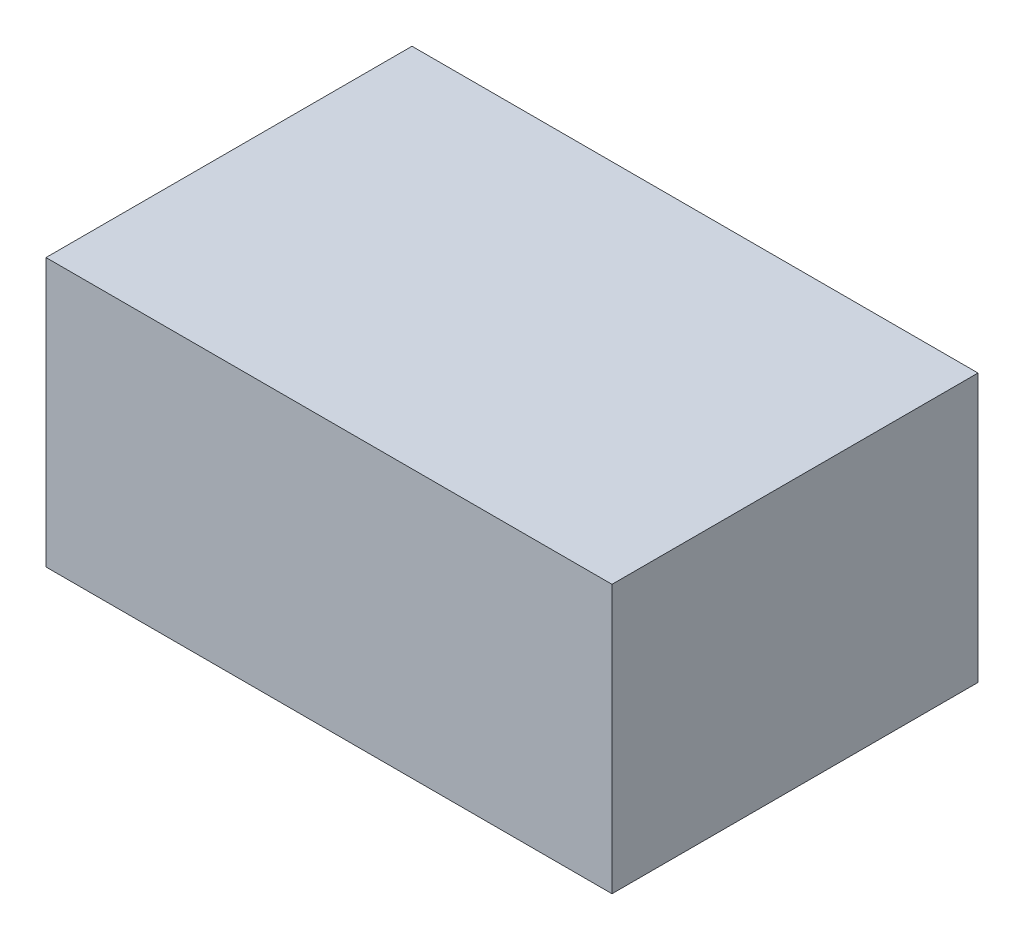
ISO-10303-21;
HEADER;
FILE_DESCRIPTION(('STEP AP214'),'2;1');
FILE_NAME('part.step','',(''),(''),'','','');
FILE_SCHEMA(('AUTOMOTIVE_DESIGN { 1 0 10303 214 1 1 1 1 }'));
ENDSEC;
DATA;
#1=APPLICATION_CONTEXT('core data for automotive mechanical design processes');
#2=APPLICATION_PROTOCOL_DEFINITION('international standard','automotive_design',2000,#1);
#3=PRODUCT_CONTEXT('',#1,'mechanical');
#4=PRODUCT('Part','Part','',(#3));
#5=PRODUCT_RELATED_PRODUCT_CATEGORY('part','',(#4));
#6=PRODUCT_DEFINITION_FORMATION('','',#4);
#7=PRODUCT_DEFINITION_CONTEXT('part definition',#1,'design');
#8=PRODUCT_DEFINITION('design','',#6,#7);
#9=PRODUCT_DEFINITION_SHAPE('','',#8);
#10=(LENGTH_UNIT() NAMED_UNIT(*) SI_UNIT(.MILLI.,.METRE.));
#11=(NAMED_UNIT(*) PLANE_ANGLE_UNIT() SI_UNIT($,.RADIAN.));
#12=(NAMED_UNIT(*) SI_UNIT($,.STERADIAN.) SOLID_ANGLE_UNIT());
#13=UNCERTAINTY_MEASURE_WITH_UNIT(LENGTH_MEASURE(1.E-05),#10,'distance_accuracy_value','');
#14=(GEOMETRIC_REPRESENTATION_CONTEXT(3) GLOBAL_UNCERTAINTY_ASSIGNED_CONTEXT((#13)) GLOBAL_UNIT_ASSIGNED_CONTEXT((#10,
#11,#12)) REPRESENTATION_CONTEXT('',''));
#15=CARTESIAN_POINT('',(0.,0.,0.));
#16=DIRECTION('',(0.,0.,1.));
#17=DIRECTION('',(1.,0.,0.));
#18=AXIS2_PLACEMENT_3D('',#15,#16,#17);
#19=CARTESIAN_POINT('',(0.,0.,46.482));
#20=DIRECTION('',(1.,0.,0.));
#21=DIRECTION('',(0.,0.,-1.));
#22=AXIS2_PLACEMENT_3D('',#19,#20,#21);
#23=PLANE('',#22);
#24=DIRECTION('',(0.,-1.,0.));
#25=VECTOR('',#24,1.);
#26=CARTESIAN_POINT('',(0.,0.,0.));
#27=LINE('',#26,#25);
#28=CARTESIAN_POINT('',(0.,34.036,0.));
#29=VERTEX_POINT('',#28);
#30=CARTESIAN_POINT('',(0.,0.,0.));
#31=VERTEX_POINT('',#30);
#32=EDGE_CURVE('E97',#29,#31,#27,.T.);
#33=ORIENTED_EDGE('',*,*,#32,.T.);
#34=DIRECTION('',(0.,0.,-1.));
#35=VECTOR('',#34,1.);
#36=CARTESIAN_POINT('',(0.,0.,46.482));
#37=LINE('',#36,#35);
#38=CARTESIAN_POINT('',(0.,0.,46.482));
#39=VERTEX_POINT('',#38);
#40=EDGE_CURVE('E11',#39,#31,#37,.T.);
#41=ORIENTED_EDGE('',*,*,#40,.F.);
#42=DIRECTION('',(0.,-1.,0.));
#43=VECTOR('',#42,1.);
#44=CARTESIAN_POINT('',(0.,0.,46.482));
#45=LINE('',#44,#43);
#46=CARTESIAN_POINT('',(0.,34.036,46.482));
#47=VERTEX_POINT('',#46);
#48=EDGE_CURVE('E85',#47,#39,#45,.T.);
#49=ORIENTED_EDGE('',*,*,#48,.F.);
#50=DIRECTION('',(0.,0.,-1.));
#51=VECTOR('',#50,1.);
#52=CARTESIAN_POINT('',(0.,34.036,46.482));
#53=LINE('',#52,#51);
#54=EDGE_CURVE('E93',#47,#29,#53,.T.);
#55=ORIENTED_EDGE('',*,*,#54,.T.);
#56=EDGE_LOOP('',(#33,#41,#49,#55));
#57=FACE_BOUND('',#56,.T.);
#58=ADVANCED_FACE('F34',(#57),#23,.F.);
#59=CARTESIAN_POINT('',(0.,0.,46.482));
#60=DIRECTION('',(0.,1.,0.));
#61=DIRECTION('',(0.,0.,1.));
#62=AXIS2_PLACEMENT_3D('',#59,#60,#61);
#63=PLANE('',#62);
#64=DIRECTION('',(1.,0.,0.));
#65=VECTOR('',#64,1.);
#66=CARTESIAN_POINT('',(0.,0.,0.));
#67=LINE('',#66,#65);
#68=CARTESIAN_POINT('',(71.882,0.,0.));
#69=VERTEX_POINT('',#68);
#70=EDGE_CURVE('E89',#31,#69,#67,.T.);
#71=ORIENTED_EDGE('',*,*,#70,.T.);
#72=DIRECTION('',(0.,0.,-1.));
#73=VECTOR('',#72,1.);
#74=CARTESIAN_POINT('',(71.882,0.,46.482));
#75=LINE('',#74,#73);
#76=CARTESIAN_POINT('',(71.882,0.,46.482));
#77=VERTEX_POINT('',#76);
#78=EDGE_CURVE('E42',#77,#69,#75,.T.);
#79=ORIENTED_EDGE('',*,*,#78,.F.);
#80=DIRECTION('',(1.,0.,0.));
#81=VECTOR('',#80,1.);
#82=CARTESIAN_POINT('',(0.,0.,46.482));
#83=LINE('',#82,#81);
#84=EDGE_CURVE('E80',#39,#77,#83,.T.);
#85=ORIENTED_EDGE('',*,*,#84,.F.);
#86=ORIENTED_EDGE('',*,*,#40,.T.);
#87=EDGE_LOOP('',(#71,#79,#85,#86));
#88=FACE_BOUND('',#87,.T.);
#89=ADVANCED_FACE('F88',(#88),#63,.F.);
#90=CARTESIAN_POINT('',(71.882,0.,46.482));
#91=DIRECTION('',(-1.,0.,0.));
#92=DIRECTION('',(0.,0.,1.));
#93=AXIS2_PLACEMENT_3D('',#90,#91,#92);
#94=PLANE('',#93);
#95=DIRECTION('',(0.,1.,0.));
#96=VECTOR('',#95,1.);
#97=CARTESIAN_POINT('',(71.882,0.,0.));
#98=LINE('',#97,#96);
#99=CARTESIAN_POINT('',(71.882,34.036,0.));
#100=VERTEX_POINT('',#99);
#101=EDGE_CURVE('E67',#69,#100,#98,.T.);
#102=ORIENTED_EDGE('',*,*,#101,.T.);
#103=DIRECTION('',(0.,0.,-1.));
#104=VECTOR('',#103,1.);
#105=CARTESIAN_POINT('',(71.882,34.036,46.482));
#106=LINE('',#105,#104);
#107=CARTESIAN_POINT('',(71.882,34.036,46.482));
#108=VERTEX_POINT('',#107);
#109=EDGE_CURVE('E90',#108,#100,#106,.T.);
#110=ORIENTED_EDGE('',*,*,#109,.F.);
#111=DIRECTION('',(0.,1.,0.));
#112=VECTOR('',#111,1.);
#113=CARTESIAN_POINT('',(71.882,0.,46.482));
#114=LINE('',#113,#112);
#115=EDGE_CURVE('E83',#77,#108,#114,.T.);
#116=ORIENTED_EDGE('',*,*,#115,.F.);
#117=ORIENTED_EDGE('',*,*,#78,.T.);
#118=EDGE_LOOP('',(#102,#110,#116,#117));
#119=FACE_BOUND('',#118,.T.);
#120=ADVANCED_FACE('F91',(#119),#94,.F.);
#121=CARTESIAN_POINT('',(0.,34.036,46.482));
#122=DIRECTION('',(0.,-1.,0.));
#123=DIRECTION('',(0.,0.,-1.));
#124=AXIS2_PLACEMENT_3D('',#121,#122,#123);
#125=PLANE('',#124);
#126=DIRECTION('',(-1.,0.,0.));
#127=VECTOR('',#126,1.);
#128=CARTESIAN_POINT('',(0.,34.036,0.));
#129=LINE('',#128,#127);
#130=EDGE_CURVE('E73',#100,#29,#129,.T.);
#131=ORIENTED_EDGE('',*,*,#130,.T.);
#132=ORIENTED_EDGE('',*,*,#54,.F.);
#133=DIRECTION('',(-1.,0.,0.));
#134=VECTOR('',#133,1.);
#135=CARTESIAN_POINT('',(0.,34.036,46.482));
#136=LINE('',#135,#134);
#137=EDGE_CURVE('E50',#108,#47,#136,.T.);
#138=ORIENTED_EDGE('',*,*,#137,.F.);
#139=ORIENTED_EDGE('',*,*,#109,.T.);
#140=EDGE_LOOP('',(#131,#132,#138,#139));
#141=FACE_BOUND('',#140,.T.);
#142=ADVANCED_FACE('F104',(#141),#125,.F.);
#143=CARTESIAN_POINT('',(0.,0.,46.482));
#144=DIRECTION('',(0.,0.,-1.));
#145=DIRECTION('',(-1.,0.,0.));
#146=AXIS2_PLACEMENT_3D('',#143,#144,#145);
#147=PLANE('',#146);
#148=ORIENTED_EDGE('',*,*,#48,.T.);
#149=ORIENTED_EDGE('',*,*,#84,.T.);
#150=ORIENTED_EDGE('',*,*,#115,.T.);
#151=ORIENTED_EDGE('',*,*,#137,.T.);
#152=EDGE_LOOP('',(#148,#149,#150,#151));
#153=FACE_BOUND('',#152,.T.);
#154=ADVANCED_FACE('F81',(#153),#147,.F.);
#155=CARTESIAN_POINT('',(0.,0.,0.));
#156=DIRECTION('',(0.,0.,-1.));
#157=DIRECTION('',(-1.,0.,0.));
#158=AXIS2_PLACEMENT_3D('',#155,#156,#157);
#159=PLANE('',#158);
#160=ORIENTED_EDGE('',*,*,#32,.F.);
#161=ORIENTED_EDGE('',*,*,#130,.F.);
#162=ORIENTED_EDGE('',*,*,#101,.F.);
#163=ORIENTED_EDGE('',*,*,#70,.F.);
#164=EDGE_LOOP('',(#160,#161,#162,#163));
#165=FACE_BOUND('',#164,.T.);
#166=ADVANCED_FACE('F107',(#165),#159,.T.);
#167=CLOSED_SHELL('',(#58,#89,#120,#142,#154,#166));
#168=MANIFOLD_SOLID_BREP('B2',#167);
#169=ADVANCED_BREP_SHAPE_REPRESENTATION('',(#18,#168),#14);
#170=SHAPE_DEFINITION_REPRESENTATION(#9,#169);
ENDSEC;
END-ISO-10303-21;
